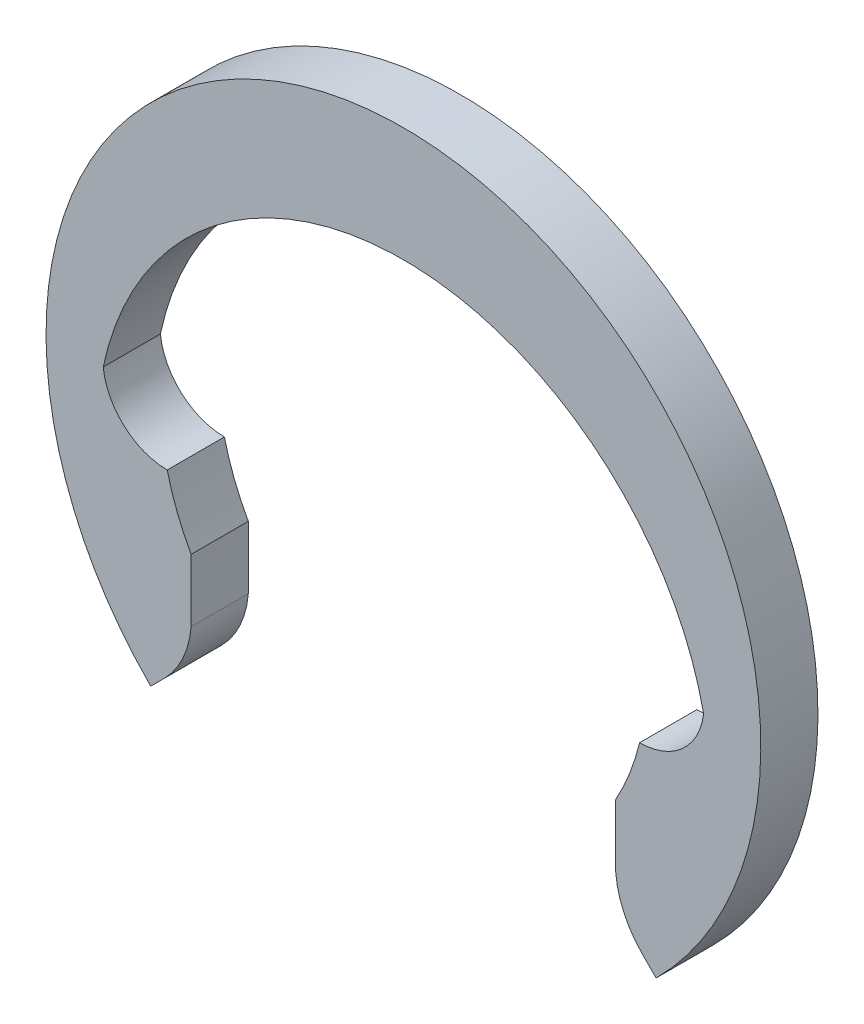
ISO-10303-21;
HEADER;
FILE_DESCRIPTION(('STEP AP214'),'2;1');
FILE_NAME('part.step','',(''),(''),'','','');
FILE_SCHEMA(('AUTOMOTIVE_DESIGN { 1 0 10303 214 1 1 1 1 }'));
ENDSEC;
DATA;
#1=APPLICATION_CONTEXT('core data for automotive mechanical design processes');
#2=APPLICATION_PROTOCOL_DEFINITION('international standard','automotive_design',2000,#1);
#3=PRODUCT_CONTEXT('',#1,'mechanical');
#4=PRODUCT('Part','Part','',(#3));
#5=PRODUCT_RELATED_PRODUCT_CATEGORY('part','',(#4));
#6=PRODUCT_DEFINITION_FORMATION('','',#4);
#7=PRODUCT_DEFINITION_CONTEXT('part definition',#1,'design');
#8=PRODUCT_DEFINITION('design','',#6,#7);
#9=PRODUCT_DEFINITION_SHAPE('','',#8);
#10=(LENGTH_UNIT() NAMED_UNIT(*) SI_UNIT(.MILLI.,.METRE.));
#11=(NAMED_UNIT(*) PLANE_ANGLE_UNIT() SI_UNIT($,.RADIAN.));
#12=(NAMED_UNIT(*) SI_UNIT($,.STERADIAN.) SOLID_ANGLE_UNIT());
#13=UNCERTAINTY_MEASURE_WITH_UNIT(LENGTH_MEASURE(1.E-05),#10,'distance_accuracy_value','');
#14=(GEOMETRIC_REPRESENTATION_CONTEXT(3) GLOBAL_UNCERTAINTY_ASSIGNED_CONTEXT((#13)) GLOBAL_UNIT_ASSIGNED_CONTEXT((#10,
#11,#12)) REPRESENTATION_CONTEXT('',''));
#15=CARTESIAN_POINT('',(0.,0.,0.));
#16=DIRECTION('',(0.,0.,1.));
#17=DIRECTION('',(1.,0.,0.));
#18=AXIS2_PLACEMENT_3D('',#15,#16,#17);
#19=CARTESIAN_POINT('',(-3.30454232837166,0.101152776048779,0.8));
#20=DIRECTION('',(0.,0.,-1.));
#21=DIRECTION('',(-1.,0.,0.));
#22=AXIS2_PLACEMENT_3D('',#19,#20,#21);
#23=CYLINDRICAL_SURFACE('',#22,0.901152776048779);
#24=CARTESIAN_POINT('',(-3.30454232837166,0.101152776048779,0.));
#25=DIRECTION('',(0.,0.,-1.));
#26=DIRECTION('',(1.,0.,0.));
#27=AXIS2_PLACEMENT_3D('',#24,#25,#26);
#28=CIRCLE('',#27,0.901152776048779);
#29=CARTESIAN_POINT('',(-3.30454232837166,-0.8,0.));
#30=VERTEX_POINT('',#29);
#31=CARTESIAN_POINT('',(-4.2,0.,0.));
#32=VERTEX_POINT('',#31);
#33=EDGE_CURVE('E189',#30,#32,#28,.T.);
#34=ORIENTED_EDGE('',*,*,#33,.T.);
#35=DIRECTION('',(0.,0.,-1.));
#36=VECTOR('',#35,1.);
#37=CARTESIAN_POINT('',(-4.2,0.,0.8));
#38=LINE('',#37,#36);
#39=CARTESIAN_POINT('',(-4.2,0.,0.8));
#40=VERTEX_POINT('',#39);
#41=EDGE_CURVE('E11',#40,#32,#38,.T.);
#42=ORIENTED_EDGE('',*,*,#41,.F.);
#43=CARTESIAN_POINT('',(-3.30454232837166,0.101152776048779,0.8));
#44=DIRECTION('',(0.,0.,-1.));
#45=DIRECTION('',(1.,0.,0.));
#46=AXIS2_PLACEMENT_3D('',#43,#44,#45);
#47=CIRCLE('',#46,0.901152776048779);
#48=CARTESIAN_POINT('',(-3.30454232837166,-0.8,0.8));
#49=VERTEX_POINT('',#48);
#50=EDGE_CURVE('E224',#49,#40,#47,.T.);
#51=ORIENTED_EDGE('',*,*,#50,.F.);
#52=DIRECTION('',(0.,0.,-1.));
#53=VECTOR('',#52,1.);
#54=CARTESIAN_POINT('',(-3.30454232837166,-0.8,0.8));
#55=LINE('',#54,#53);
#56=EDGE_CURVE('E185',#49,#30,#55,.T.);
#57=ORIENTED_EDGE('',*,*,#56,.T.);
#58=EDGE_LOOP('',(#34,#42,#51,#57));
#59=FACE_BOUND('',#58,.T.);
#60=ADVANCED_FACE('F38',(#59),#23,.F.);
#61=CARTESIAN_POINT('',(0.,-0.894117647058823,0.8));
#62=DIRECTION('',(0.,0.,-1.));
#63=DIRECTION('',(-1.,0.,0.));
#64=AXIS2_PLACEMENT_3D('',#61,#62,#63);
#65=CYLINDRICAL_SURFACE('',#64,4.29411764705883);
#66=CARTESIAN_POINT('',(0.,-0.894117647058823,0.));
#67=DIRECTION('',(0.,0.,-1.));
#68=DIRECTION('',(1.,0.,0.));
#69=AXIS2_PLACEMENT_3D('',#66,#67,#68);
#70=CIRCLE('',#69,4.29411764705883);
#71=CARTESIAN_POINT('',(4.2,0.,0.));
#72=VERTEX_POINT('',#71);
#73=EDGE_CURVE('E193',#32,#72,#70,.T.);
#74=ORIENTED_EDGE('',*,*,#73,.T.);
#75=DIRECTION('',(0.,0.,-1.));
#76=VECTOR('',#75,1.);
#77=CARTESIAN_POINT('',(4.2,0.,0.8));
#78=LINE('',#77,#76);
#79=CARTESIAN_POINT('',(4.2,0.,0.8));
#80=VERTEX_POINT('',#79);
#81=EDGE_CURVE('E47',#80,#72,#78,.T.);
#82=ORIENTED_EDGE('',*,*,#81,.F.);
#83=CARTESIAN_POINT('',(0.,-0.894117647058823,0.8));
#84=DIRECTION('',(0.,0.,-1.));
#85=DIRECTION('',(1.,0.,0.));
#86=AXIS2_PLACEMENT_3D('',#83,#84,#85);
#87=CIRCLE('',#86,4.29411764705883);
#88=EDGE_CURVE('E125',#40,#80,#87,.T.);
#89=ORIENTED_EDGE('',*,*,#88,.F.);
#90=ORIENTED_EDGE('',*,*,#41,.T.);
#91=EDGE_LOOP('',(#74,#82,#89,#90));
#92=FACE_BOUND('',#91,.T.);
#93=ADVANCED_FACE('F316',(#92),#65,.F.);
#94=CARTESIAN_POINT('',(3.30454232837166,0.10115277604878,0.8));
#95=DIRECTION('',(0.,0.,-1.));
#96=DIRECTION('',(-1.,0.,0.));
#97=AXIS2_PLACEMENT_3D('',#94,#95,#96);
#98=CYLINDRICAL_SURFACE('',#97,0.90115277604878);
#99=CARTESIAN_POINT('',(3.30454232837166,0.10115277604878,0.));
#100=DIRECTION('',(0.,0.,-1.));
#101=DIRECTION('',(-1.,0.,0.));
#102=AXIS2_PLACEMENT_3D('',#99,#100,#101);
#103=CIRCLE('',#102,0.90115277604878);
#104=CARTESIAN_POINT('',(3.30454232837166,-0.8,0.));
#105=VERTEX_POINT('',#104);
#106=EDGE_CURVE('E196',#72,#105,#103,.T.);
#107=ORIENTED_EDGE('',*,*,#106,.T.);
#108=DIRECTION('',(0.,0.,-1.));
#109=VECTOR('',#108,1.);
#110=CARTESIAN_POINT('',(3.30454232837166,-0.8,0.8));
#111=LINE('',#110,#109);
#112=CARTESIAN_POINT('',(3.30454232837166,-0.8,0.8));
#113=VERTEX_POINT('',#112);
#114=EDGE_CURVE('E250',#113,#105,#111,.T.);
#115=ORIENTED_EDGE('',*,*,#114,.F.);
#116=CARTESIAN_POINT('',(3.30454232837166,0.10115277604878,0.8));
#117=DIRECTION('',(0.,0.,-1.));
#118=DIRECTION('',(-1.,0.,0.));
#119=AXIS2_PLACEMENT_3D('',#116,#117,#118);
#120=CIRCLE('',#119,0.90115277604878);
#121=EDGE_CURVE('E261',#80,#113,#120,.T.);
#122=ORIENTED_EDGE('',*,*,#121,.F.);
#123=ORIENTED_EDGE('',*,*,#81,.T.);
#124=EDGE_LOOP('',(#107,#115,#122,#123));
#125=FACE_BOUND('',#124,.T.);
#126=ADVANCED_FACE('F259',(#125),#98,.F.);
#127=CARTESIAN_POINT('',(0.,0.,0.8));
#128=DIRECTION('',(0.,0.,-1.));
#129=DIRECTION('',(-1.,0.,0.));
#130=AXIS2_PLACEMENT_3D('',#127,#128,#129);
#131=CYLINDRICAL_SURFACE('',#130,3.4);
#132=CARTESIAN_POINT('',(0.,0.,0.));
#133=DIRECTION('',(0.,0.,-1.));
#134=DIRECTION('',(-1.,0.,0.));
#135=AXIS2_PLACEMENT_3D('',#132,#133,#134);
#136=CIRCLE('',#135,3.4);
#137=CARTESIAN_POINT('',(2.96984848098351,-1.65529453572467,0.));
#138=VERTEX_POINT('',#137);
#139=EDGE_CURVE('E199',#105,#138,#136,.T.);
#140=ORIENTED_EDGE('',*,*,#139,.T.);
#141=DIRECTION('',(0.,0.,-1.));
#142=VECTOR('',#141,1.);
#143=CARTESIAN_POINT('',(2.96984848098351,-1.65529453572467,0.8));
#144=LINE('',#143,#142);
#145=CARTESIAN_POINT('',(2.96984848098351,-1.65529453572467,0.8));
#146=VERTEX_POINT('',#145);
#147=EDGE_CURVE('E246',#146,#138,#144,.T.);
#148=ORIENTED_EDGE('',*,*,#147,.F.);
#149=CARTESIAN_POINT('',(0.,0.,0.8));
#150=DIRECTION('',(0.,0.,-1.));
#151=DIRECTION('',(-1.,0.,0.));
#152=AXIS2_PLACEMENT_3D('',#149,#150,#151);
#153=CIRCLE('',#152,3.4);
#154=EDGE_CURVE('E279',#113,#146,#153,.T.);
#155=ORIENTED_EDGE('',*,*,#154,.F.);
#156=ORIENTED_EDGE('',*,*,#114,.T.);
#157=EDGE_LOOP('',(#140,#148,#155,#156));
#158=FACE_BOUND('',#157,.T.);
#159=ADVANCED_FACE('F269',(#158),#131,.F.);
#160=CARTESIAN_POINT('',(2.96984848098351,-2.53166383256389,0.8));
#161=DIRECTION('',(1.,0.,0.));
#162=DIRECTION('',(0.,0.,-1.));
#163=AXIS2_PLACEMENT_3D('',#160,#161,#162);
#164=PLANE('',#163);
#165=DIRECTION('',(0.,-1.,0.));
#166=VECTOR('',#165,1.);
#167=CARTESIAN_POINT('',(2.96984848098351,-2.53166383256389,0.));
#168=LINE('',#167,#166);
#169=CARTESIAN_POINT('',(2.96984848098351,-2.53166383256389,0.));
#170=VERTEX_POINT('',#169);
#171=EDGE_CURVE('E203',#138,#170,#168,.T.);
#172=ORIENTED_EDGE('',*,*,#171,.T.);
#173=DIRECTION('',(0.,0.,-1.));
#174=VECTOR('',#173,1.);
#175=CARTESIAN_POINT('',(2.96984848098351,-2.53166383256389,0.8));
#176=LINE('',#175,#174);
#177=CARTESIAN_POINT('',(2.96984848098351,-2.53166383256389,0.8));
#178=VERTEX_POINT('',#177);
#179=EDGE_CURVE('E242',#178,#170,#176,.T.);
#180=ORIENTED_EDGE('',*,*,#179,.F.);
#181=DIRECTION('',(0.,-1.,0.));
#182=VECTOR('',#181,1.);
#183=CARTESIAN_POINT('',(2.96984848098351,-2.09347918414428,0.8));
#184=LINE('',#183,#182);
#185=EDGE_CURVE('E275',#146,#178,#184,.T.);
#186=ORIENTED_EDGE('',*,*,#185,.F.);
#187=ORIENTED_EDGE('',*,*,#147,.T.);
#188=EDGE_LOOP('',(#172,#180,#186,#187));
#189=FACE_BOUND('',#188,.T.);
#190=ADVANCED_FACE('F273',(#189),#164,.F.);
#191=CARTESIAN_POINT('',(4.26775947822795,-2.4261847170047,0.8));
#192=DIRECTION('',(0.,0.,-1.));
#193=DIRECTION('',(-1.,0.,0.));
#194=AXIS2_PLACEMENT_3D('',#191,#192,#193);
#195=CYLINDRICAL_SURFACE('',#194,1.30219000172295);
#196=CARTESIAN_POINT('',(4.26775947822795,-2.4261847170047,0.));
#197=DIRECTION('',(0.,0.,1.));
#198=DIRECTION('',(1.,0.,0.));
#199=AXIS2_PLACEMENT_3D('',#196,#197,#198);
#200=CIRCLE('',#199,1.30219000172295);
#201=CARTESIAN_POINT('',(3.34697209761633,-3.34697209761632,0.));
#202=VERTEX_POINT('',#201);
#203=EDGE_CURVE('E206',#170,#202,#200,.T.);
#204=ORIENTED_EDGE('',*,*,#203,.T.);
#205=DIRECTION('',(0.,0.,-1.));
#206=VECTOR('',#205,1.);
#207=CARTESIAN_POINT('',(3.34697209761633,-3.34697209761632,0.8));
#208=LINE('',#207,#206);
#209=CARTESIAN_POINT('',(3.34697209761633,-3.34697209761632,0.8));
#210=VERTEX_POINT('',#209);
#211=EDGE_CURVE('E238',#210,#202,#208,.T.);
#212=ORIENTED_EDGE('',*,*,#211,.F.);
#213=CARTESIAN_POINT('',(4.26775947822795,-2.4261847170047,0.8));
#214=DIRECTION('',(0.,0.,1.));
#215=DIRECTION('',(1.,0.,0.));
#216=AXIS2_PLACEMENT_3D('',#213,#214,#215);
#217=CIRCLE('',#216,1.30219000172295);
#218=EDGE_CURVE('E278',#178,#210,#217,.T.);
#219=ORIENTED_EDGE('',*,*,#218,.F.);
#220=ORIENTED_EDGE('',*,*,#179,.T.);
#221=EDGE_LOOP('',(#204,#212,#219,#220));
#222=FACE_BOUND('',#221,.T.);
#223=ADVANCED_FACE('F329',(#222),#195,.T.);
#224=CARTESIAN_POINT('',(3.34697209761633,-3.34697209761632,0.8));
#225=DIRECTION('',(0.70710678118655,0.707106781186545,0.));
#226=DIRECTION('',(-0.707106781186545,0.70710678118655,0.));
#227=AXIS2_PLACEMENT_3D('',#224,#225,#226);
#228=PLANE('',#227);
#229=DIRECTION('',(0.707106781186545,-0.70710678118655,0.));
#230=VECTOR('',#229,1.);
#231=CARTESIAN_POINT('',(3.34697209761633,-3.34697209761632,0.));
#232=LINE('',#231,#230);
#233=CARTESIAN_POINT('',(3.53553390593274,-3.53553390593273,0.));
#234=VERTEX_POINT('',#233);
#235=EDGE_CURVE('E209',#202,#234,#232,.T.);
#236=ORIENTED_EDGE('',*,*,#235,.T.);
#237=DIRECTION('',(0.,0.,-1.));
#238=VECTOR('',#237,1.);
#239=CARTESIAN_POINT('',(3.53553390593274,-3.53553390593273,0.8));
#240=LINE('',#239,#238);
#241=CARTESIAN_POINT('',(3.53553390593274,-3.53553390593273,0.8));
#242=VERTEX_POINT('',#241);
#243=EDGE_CURVE('E234',#242,#234,#240,.T.);
#244=ORIENTED_EDGE('',*,*,#243,.F.);
#245=DIRECTION('',(0.707106781186545,-0.70710678118655,0.));
#246=VECTOR('',#245,1.);
#247=CARTESIAN_POINT('',(3.34697209761633,-3.34697209761632,0.8));
#248=LINE('',#247,#246);
#249=EDGE_CURVE('E283',#210,#242,#248,.T.);
#250=ORIENTED_EDGE('',*,*,#249,.F.);
#251=ORIENTED_EDGE('',*,*,#211,.T.);
#252=EDGE_LOOP('',(#236,#244,#250,#251));
#253=FACE_BOUND('',#252,.T.);
#254=ADVANCED_FACE('F332',(#253),#228,.F.);
#255=CARTESIAN_POINT('',(0.,0.,0.8));
#256=DIRECTION('',(0.,0.,-1.));
#257=DIRECTION('',(-1.,0.,0.));
#258=AXIS2_PLACEMENT_3D('',#255,#256,#257);
#259=CYLINDRICAL_SURFACE('',#258,5.);
#260=CARTESIAN_POINT('',(0.,0.,0.));
#261=DIRECTION('',(0.,0.,1.));
#262=DIRECTION('',(1.,0.,0.));
#263=AXIS2_PLACEMENT_3D('',#260,#261,#262);
#264=CIRCLE('',#263,5.);
#265=CARTESIAN_POINT('',(-3.53553390593274,-3.53553390593273,0.));
#266=VERTEX_POINT('',#265);
#267=EDGE_CURVE('E212',#234,#266,#264,.T.);
#268=ORIENTED_EDGE('',*,*,#267,.T.);
#269=DIRECTION('',(0.,0.,-1.));
#270=VECTOR('',#269,1.);
#271=CARTESIAN_POINT('',(-3.53553390593274,-3.53553390593273,0.8));
#272=LINE('',#271,#270);
#273=CARTESIAN_POINT('',(-3.53553390593274,-3.53553390593273,0.8));
#274=VERTEX_POINT('',#273);
#275=EDGE_CURVE('E230',#274,#266,#272,.T.);
#276=ORIENTED_EDGE('',*,*,#275,.F.);
#277=CARTESIAN_POINT('',(0.,0.,0.8));
#278=DIRECTION('',(0.,0.,1.));
#279=DIRECTION('',(1.,0.,0.));
#280=AXIS2_PLACEMENT_3D('',#277,#278,#279);
#281=CIRCLE('',#280,5.);
#282=EDGE_CURVE('E290',#242,#274,#281,.T.);
#283=ORIENTED_EDGE('',*,*,#282,.F.);
#284=ORIENTED_EDGE('',*,*,#243,.T.);
#285=EDGE_LOOP('',(#268,#276,#283,#284));
#286=FACE_BOUND('',#285,.T.);
#287=ADVANCED_FACE('F297',(#286),#259,.T.);
#288=CARTESIAN_POINT('',(-3.34697209761633,-3.34697209761632,0.8));
#289=DIRECTION('',(-0.70710678118655,0.707106781186545,0.));
#290=DIRECTION('',(-0.707106781186545,-0.70710678118655,0.));
#291=AXIS2_PLACEMENT_3D('',#288,#289,#290);
#292=PLANE('',#291);
#293=DIRECTION('',(0.707106781186545,0.70710678118655,0.));
#294=VECTOR('',#293,1.);
#295=CARTESIAN_POINT('',(-3.34697209761633,-3.34697209761632,0.));
#296=LINE('',#295,#294);
#297=CARTESIAN_POINT('',(-3.34697209761633,-3.34697209761632,0.));
#298=VERTEX_POINT('',#297);
#299=EDGE_CURVE('E215',#266,#298,#296,.T.);
#300=ORIENTED_EDGE('',*,*,#299,.T.);
#301=DIRECTION('',(0.,0.,-1.));
#302=VECTOR('',#301,1.);
#303=CARTESIAN_POINT('',(-3.34697209761633,-3.34697209761632,0.8));
#304=LINE('',#303,#302);
#305=CARTESIAN_POINT('',(-3.34697209761633,-3.34697209761632,0.8));
#306=VERTEX_POINT('',#305);
#307=EDGE_CURVE('E176',#306,#298,#304,.T.);
#308=ORIENTED_EDGE('',*,*,#307,.F.);
#309=DIRECTION('',(0.707106781186545,0.70710678118655,0.));
#310=VECTOR('',#309,1.);
#311=CARTESIAN_POINT('',(-3.34697209761633,-3.34697209761632,0.8));
#312=LINE('',#311,#310);
#313=EDGE_CURVE('E164',#274,#306,#312,.T.);
#314=ORIENTED_EDGE('',*,*,#313,.F.);
#315=ORIENTED_EDGE('',*,*,#275,.T.);
#316=EDGE_LOOP('',(#300,#308,#314,#315));
#317=FACE_BOUND('',#316,.T.);
#318=ADVANCED_FACE('F301',(#317),#292,.F.);
#319=CARTESIAN_POINT('',(-4.26775947822795,-2.4261847170047,0.8));
#320=DIRECTION('',(0.,0.,-1.));
#321=DIRECTION('',(-1.,0.,0.));
#322=AXIS2_PLACEMENT_3D('',#319,#320,#321);
#323=CYLINDRICAL_SURFACE('',#322,1.30219000172295);
#324=CARTESIAN_POINT('',(-4.26775947822795,-2.4261847170047,0.));
#325=DIRECTION('',(0.,0.,1.));
#326=DIRECTION('',(-1.,0.,0.));
#327=AXIS2_PLACEMENT_3D('',#324,#325,#326);
#328=CIRCLE('',#327,1.30219000172295);
#329=CARTESIAN_POINT('',(-2.9698484809835,-2.53166383256389,0.));
#330=VERTEX_POINT('',#329);
#331=EDGE_CURVE('E174',#298,#330,#328,.T.);
#332=ORIENTED_EDGE('',*,*,#331,.T.);
#333=DIRECTION('',(0.,0.,-1.));
#334=VECTOR('',#333,1.);
#335=CARTESIAN_POINT('',(-2.9698484809835,-2.53166383256389,0.8));
#336=LINE('',#335,#334);
#337=CARTESIAN_POINT('',(-2.9698484809835,-2.53166383256389,0.8));
#338=VERTEX_POINT('',#337);
#339=EDGE_CURVE('E171',#338,#330,#336,.T.);
#340=ORIENTED_EDGE('',*,*,#339,.F.);
#341=CARTESIAN_POINT('',(-4.26775947822795,-2.4261847170047,0.8));
#342=DIRECTION('',(0.,0.,1.));
#343=DIRECTION('',(-1.,0.,0.));
#344=AXIS2_PLACEMENT_3D('',#341,#342,#343);
#345=CIRCLE('',#344,1.30219000172295);
#346=EDGE_CURVE('E158',#306,#338,#345,.T.);
#347=ORIENTED_EDGE('',*,*,#346,.F.);
#348=ORIENTED_EDGE('',*,*,#307,.T.);
#349=EDGE_LOOP('',(#332,#340,#347,#348));
#350=FACE_BOUND('',#349,.T.);
#351=ADVANCED_FACE('F172',(#350),#323,.T.);
#352=CARTESIAN_POINT('',(-2.9698484809835,-2.09347918414428,0.8));
#353=DIRECTION('',(-1.,0.,0.));
#354=DIRECTION('',(0.,0.,1.));
#355=AXIS2_PLACEMENT_3D('',#352,#353,#354);
#356=PLANE('',#355);
#357=DIRECTION('',(0.,1.,0.));
#358=VECTOR('',#357,1.);
#359=CARTESIAN_POINT('',(-2.9698484809835,-2.09347918414428,0.));
#360=LINE('',#359,#358);
#361=CARTESIAN_POINT('',(-2.9698484809835,-1.65529453572468,0.));
#362=VERTEX_POINT('',#361);
#363=EDGE_CURVE('E111',#330,#362,#360,.T.);
#364=ORIENTED_EDGE('',*,*,#363,.T.);
#365=DIRECTION('',(0.,0.,-1.));
#366=VECTOR('',#365,1.);
#367=CARTESIAN_POINT('',(-2.9698484809835,-1.65529453572468,0.8));
#368=LINE('',#367,#366);
#369=CARTESIAN_POINT('',(-2.9698484809835,-1.65529453572468,0.8));
#370=VERTEX_POINT('',#369);
#371=EDGE_CURVE('E177',#370,#362,#368,.T.);
#372=ORIENTED_EDGE('',*,*,#371,.F.);
#373=DIRECTION('',(0.,1.,0.));
#374=VECTOR('',#373,1.);
#375=CARTESIAN_POINT('',(-2.9698484809835,-2.53166383256389,0.8));
#376=LINE('',#375,#374);
#377=EDGE_CURVE('E162',#338,#370,#376,.T.);
#378=ORIENTED_EDGE('',*,*,#377,.F.);
#379=ORIENTED_EDGE('',*,*,#339,.T.);
#380=EDGE_LOOP('',(#364,#372,#378,#379));
#381=FACE_BOUND('',#380,.T.);
#382=ADVANCED_FACE('F179',(#381),#356,.F.);
#383=CARTESIAN_POINT('',(0.,0.,0.8));
#384=DIRECTION('',(0.,0.,-1.));
#385=DIRECTION('',(-1.,0.,0.));
#386=AXIS2_PLACEMENT_3D('',#383,#384,#385);
#387=CYLINDRICAL_SURFACE('',#386,3.4);
#388=CARTESIAN_POINT('',(0.,0.,0.));
#389=DIRECTION('',(0.,0.,-1.));
#390=DIRECTION('',(1.,0.,0.));
#391=AXIS2_PLACEMENT_3D('',#388,#389,#390);
#392=CIRCLE('',#391,3.4);
#393=EDGE_CURVE('E117',#362,#30,#392,.T.);
#394=ORIENTED_EDGE('',*,*,#393,.T.);
#395=ORIENTED_EDGE('',*,*,#56,.F.);
#396=CARTESIAN_POINT('',(0.,0.,0.8));
#397=DIRECTION('',(0.,0.,-1.));
#398=DIRECTION('',(1.,0.,0.));
#399=AXIS2_PLACEMENT_3D('',#396,#397,#398);
#400=CIRCLE('',#399,3.4);
#401=EDGE_CURVE('E58',#370,#49,#400,.T.);
#402=ORIENTED_EDGE('',*,*,#401,.F.);
#403=ORIENTED_EDGE('',*,*,#371,.T.);
#404=EDGE_LOOP('',(#394,#395,#402,#403));
#405=FACE_BOUND('',#404,.T.);
#406=ADVANCED_FACE('F305',(#405),#387,.F.);
#407=CARTESIAN_POINT('',(-3.30454232837166,0.101152776048779,0.8));
#408=DIRECTION('',(0.,0.,1.));
#409=DIRECTION('',(1.,0.,0.));
#410=AXIS2_PLACEMENT_3D('',#407,#408,#409);
#411=PLANE('',#410);
#412=ORIENTED_EDGE('',*,*,#50,.T.);
#413=ORIENTED_EDGE('',*,*,#88,.T.);
#414=ORIENTED_EDGE('',*,*,#121,.T.);
#415=ORIENTED_EDGE('',*,*,#154,.T.);
#416=ORIENTED_EDGE('',*,*,#185,.T.);
#417=ORIENTED_EDGE('',*,*,#218,.T.);
#418=ORIENTED_EDGE('',*,*,#249,.T.);
#419=ORIENTED_EDGE('',*,*,#282,.T.);
#420=ORIENTED_EDGE('',*,*,#313,.T.);
#421=ORIENTED_EDGE('',*,*,#346,.T.);
#422=ORIENTED_EDGE('',*,*,#377,.T.);
#423=ORIENTED_EDGE('',*,*,#401,.T.);
#424=EDGE_LOOP('',(#412,#413,#414,#415,#416,#417,#418,#419,#420,#421,#422,#423));
#425=FACE_BOUND('',#424,.T.);
#426=ADVANCED_FACE('F160',(#425),#411,.T.);
#427=CARTESIAN_POINT('',(-3.30454232837166,0.101152776048779,0.));
#428=DIRECTION('',(0.,0.,1.));
#429=DIRECTION('',(1.,0.,0.));
#430=AXIS2_PLACEMENT_3D('',#427,#428,#429);
#431=PLANE('',#430);
#432=ORIENTED_EDGE('',*,*,#33,.F.);
#433=ORIENTED_EDGE('',*,*,#393,.F.);
#434=ORIENTED_EDGE('',*,*,#363,.F.);
#435=ORIENTED_EDGE('',*,*,#331,.F.);
#436=ORIENTED_EDGE('',*,*,#299,.F.);
#437=ORIENTED_EDGE('',*,*,#267,.F.);
#438=ORIENTED_EDGE('',*,*,#235,.F.);
#439=ORIENTED_EDGE('',*,*,#203,.F.);
#440=ORIENTED_EDGE('',*,*,#171,.F.);
#441=ORIENTED_EDGE('',*,*,#139,.F.);
#442=ORIENTED_EDGE('',*,*,#106,.F.);
#443=ORIENTED_EDGE('',*,*,#73,.F.);
#444=EDGE_LOOP('',(#432,#433,#434,#435,#436,#437,#438,#439,#440,#441,#442,#443));
#445=FACE_BOUND('',#444,.T.);
#446=ADVANCED_FACE('F265',(#445),#431,.F.);
#447=CLOSED_SHELL('',(#60,#93,#126,#159,#190,#223,#254,#287,#318,#351,#382,#406,#426,#446));
#448=MANIFOLD_SOLID_BREP('B2',#447);
#449=ADVANCED_BREP_SHAPE_REPRESENTATION('',(#18,#448),#14);
#450=SHAPE_DEFINITION_REPRESENTATION(#9,#449);
ENDSEC;
END-ISO-10303-21;
